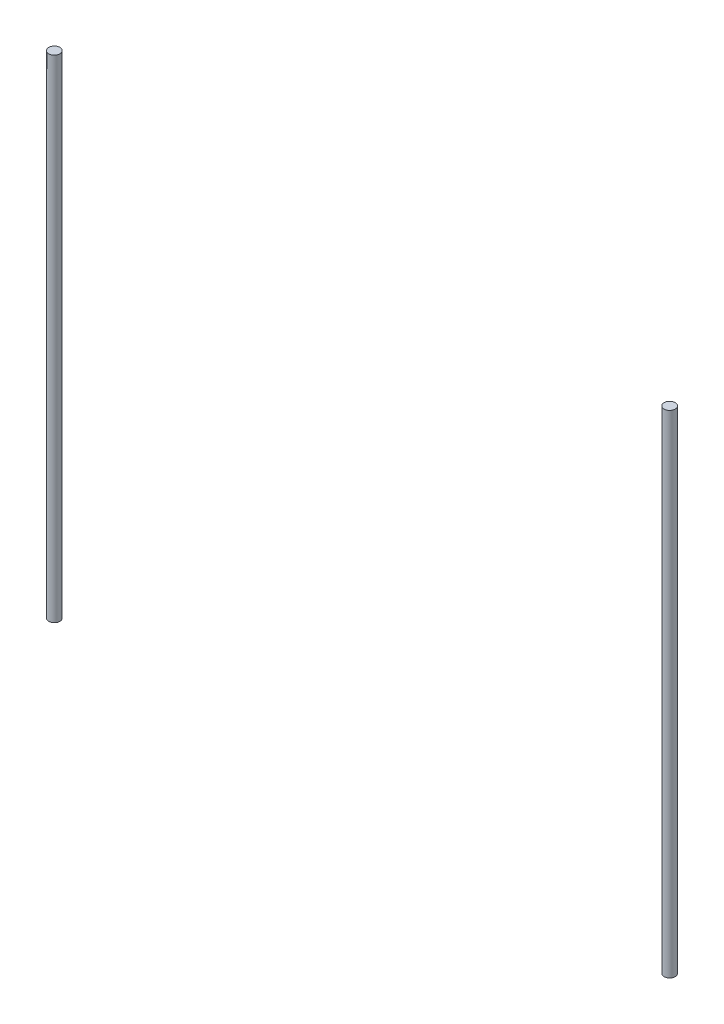
ISO-10303-21;
HEADER;
FILE_DESCRIPTION(('STEP AP214'),'2;1');
FILE_NAME('part.step','',(''),(''),'','','');
FILE_SCHEMA(('AUTOMOTIVE_DESIGN { 1 0 10303 214 1 1 1 1 }'));
ENDSEC;
DATA;
#1=APPLICATION_CONTEXT('core data for automotive mechanical design processes');
#2=APPLICATION_PROTOCOL_DEFINITION('international standard','automotive_design',2000,#1);
#3=PRODUCT_CONTEXT('',#1,'mechanical');
#4=PRODUCT('Part','Part','',(#3));
#5=PRODUCT_RELATED_PRODUCT_CATEGORY('part','',(#4));
#6=PRODUCT_DEFINITION_FORMATION('','',#4);
#7=PRODUCT_DEFINITION_CONTEXT('part definition',#1,'design');
#8=PRODUCT_DEFINITION('design','',#6,#7);
#9=PRODUCT_DEFINITION_SHAPE('','',#8);
#10=(LENGTH_UNIT() NAMED_UNIT(*) SI_UNIT(.MILLI.,.METRE.));
#11=(NAMED_UNIT(*) PLANE_ANGLE_UNIT() SI_UNIT($,.RADIAN.));
#12=(NAMED_UNIT(*) SI_UNIT($,.STERADIAN.) SOLID_ANGLE_UNIT());
#13=UNCERTAINTY_MEASURE_WITH_UNIT(LENGTH_MEASURE(1.E-05),#10,'distance_accuracy_value','');
#14=(GEOMETRIC_REPRESENTATION_CONTEXT(3) GLOBAL_UNCERTAINTY_ASSIGNED_CONTEXT((#13)) GLOBAL_UNIT_ASSIGNED_CONTEXT((#10,
#11,#12)) REPRESENTATION_CONTEXT('',''));
#15=CARTESIAN_POINT('',(0.,0.,0.));
#16=DIRECTION('',(0.,0.,1.));
#17=DIRECTION('',(1.,0.,0.));
#18=AXIS2_PLACEMENT_3D('',#15,#16,#17);
#19=CARTESIAN_POINT('',(220.,351.5,0.));
#20=DIRECTION('',(0.,-1.,0.));
#21=DIRECTION('',(0.,0.,-1.));
#22=AXIS2_PLACEMENT_3D('',#19,#20,#21);
#23=CYLINDRICAL_SURFACE('',#22,3.99999999999999);
#24=CARTESIAN_POINT('',(220.,351.5,0.));
#25=DIRECTION('',(0.,1.,0.));
#26=DIRECTION('',(0.,0.,1.));
#27=AXIS2_PLACEMENT_3D('',#24,#25,#26);
#28=CIRCLE('',#27,3.99999999999999);
#29=CARTESIAN_POINT('',(220.,351.5,3.99999999999999));
#30=VERTEX_POINT('',#29);
#31=EDGE_CURVE('E11',#30,#30,#28,.T.);
#32=ORIENTED_EDGE('',*,*,#31,.F.);
#33=EDGE_LOOP('',(#32));
#34=FACE_BOUND('',#33,.T.);
#35=CARTESIAN_POINT('',(220.,0.,0.));
#36=DIRECTION('',(0.,1.,0.));
#37=DIRECTION('',(0.,0.,1.));
#38=AXIS2_PLACEMENT_3D('',#35,#36,#37);
#39=CIRCLE('',#38,3.99999999999999);
#40=CARTESIAN_POINT('',(220.,0.,3.99999999999999));
#41=VERTEX_POINT('',#40);
#42=EDGE_CURVE('E42',#41,#41,#39,.T.);
#43=ORIENTED_EDGE('',*,*,#42,.T.);
#44=EDGE_LOOP('',(#43));
#45=FACE_BOUND('',#44,.T.);
#46=ADVANCED_FACE('F39',(#34,#45),#23,.T.);
#47=CARTESIAN_POINT('',(220.,351.5,0.));
#48=DIRECTION('',(0.,1.,0.));
#49=DIRECTION('',(0.,0.,1.));
#50=AXIS2_PLACEMENT_3D('',#47,#48,#49);
#51=PLANE('',#50);
#52=ORIENTED_EDGE('',*,*,#31,.T.);
#53=EDGE_LOOP('',(#52));
#54=FACE_BOUND('',#53,.T.);
#55=ADVANCED_FACE('F54',(#54),#51,.T.);
#56=CARTESIAN_POINT('',(220.,0.,0.));
#57=DIRECTION('',(0.,1.,0.));
#58=DIRECTION('',(0.,0.,1.));
#59=AXIS2_PLACEMENT_3D('',#56,#57,#58);
#60=PLANE('',#59);
#61=ORIENTED_EDGE('',*,*,#42,.F.);
#62=EDGE_LOOP('',(#61));
#63=FACE_BOUND('',#62,.T.);
#64=ADVANCED_FACE('F52',(#63),#60,.F.);
#65=CLOSED_SHELL('',(#46,#55,#64));
#66=MANIFOLD_SOLID_BREP('B2',#65);
#67=CARTESIAN_POINT('',(-220.,351.5,0.));
#68=DIRECTION('',(0.,-1.,0.));
#69=DIRECTION('',(0.,0.,-1.));
#70=AXIS2_PLACEMENT_3D('',#67,#68,#69);
#71=CYLINDRICAL_SURFACE('',#70,3.99999999999999);
#72=CARTESIAN_POINT('',(-220.,351.5,0.));
#73=DIRECTION('',(0.,1.,0.));
#74=DIRECTION('',(0.,0.,1.));
#75=AXIS2_PLACEMENT_3D('',#72,#73,#74);
#76=CIRCLE('',#75,3.99999999999999);
#77=CARTESIAN_POINT('',(-220.,351.5,3.99999999999999));
#78=VERTEX_POINT('',#77);
#79=EDGE_CURVE('E38',#78,#78,#76,.T.);
#80=ORIENTED_EDGE('',*,*,#79,.F.);
#81=EDGE_LOOP('',(#80));
#82=FACE_BOUND('',#81,.T.);
#83=CARTESIAN_POINT('',(-220.,0.,0.));
#84=DIRECTION('',(0.,1.,0.));
#85=DIRECTION('',(0.,0.,1.));
#86=AXIS2_PLACEMENT_3D('',#83,#84,#85);
#87=CIRCLE('',#86,3.99999999999999);
#88=CARTESIAN_POINT('',(-220.,0.,3.99999999999999));
#89=VERTEX_POINT('',#88);
#90=EDGE_CURVE('E83',#89,#89,#87,.T.);
#91=ORIENTED_EDGE('',*,*,#90,.T.);
#92=EDGE_LOOP('',(#91));
#93=FACE_BOUND('',#92,.T.);
#94=ADVANCED_FACE('F80',(#82,#93),#71,.T.);
#95=CARTESIAN_POINT('',(-220.,351.5,0.));
#96=DIRECTION('',(0.,1.,0.));
#97=DIRECTION('',(0.,0.,1.));
#98=AXIS2_PLACEMENT_3D('',#95,#96,#97);
#99=PLANE('',#98);
#100=ORIENTED_EDGE('',*,*,#79,.T.);
#101=EDGE_LOOP('',(#100));
#102=FACE_BOUND('',#101,.T.);
#103=ADVANCED_FACE('F95',(#102),#99,.T.);
#104=CARTESIAN_POINT('',(-220.,0.,0.));
#105=DIRECTION('',(0.,1.,0.));
#106=DIRECTION('',(0.,0.,1.));
#107=AXIS2_PLACEMENT_3D('',#104,#105,#106);
#108=PLANE('',#107);
#109=ORIENTED_EDGE('',*,*,#90,.F.);
#110=EDGE_LOOP('',(#109));
#111=FACE_BOUND('',#110,.T.);
#112=ADVANCED_FACE('F93',(#111),#108,.F.);
#113=CLOSED_SHELL('',(#94,#103,#112));
#114=MANIFOLD_SOLID_BREP('B6',#113);
#115=ADVANCED_BREP_SHAPE_REPRESENTATION('',(#18,#66,#114),#14);
#116=SHAPE_DEFINITION_REPRESENTATION(#9,#115);
ENDSEC;
END-ISO-10303-21;
